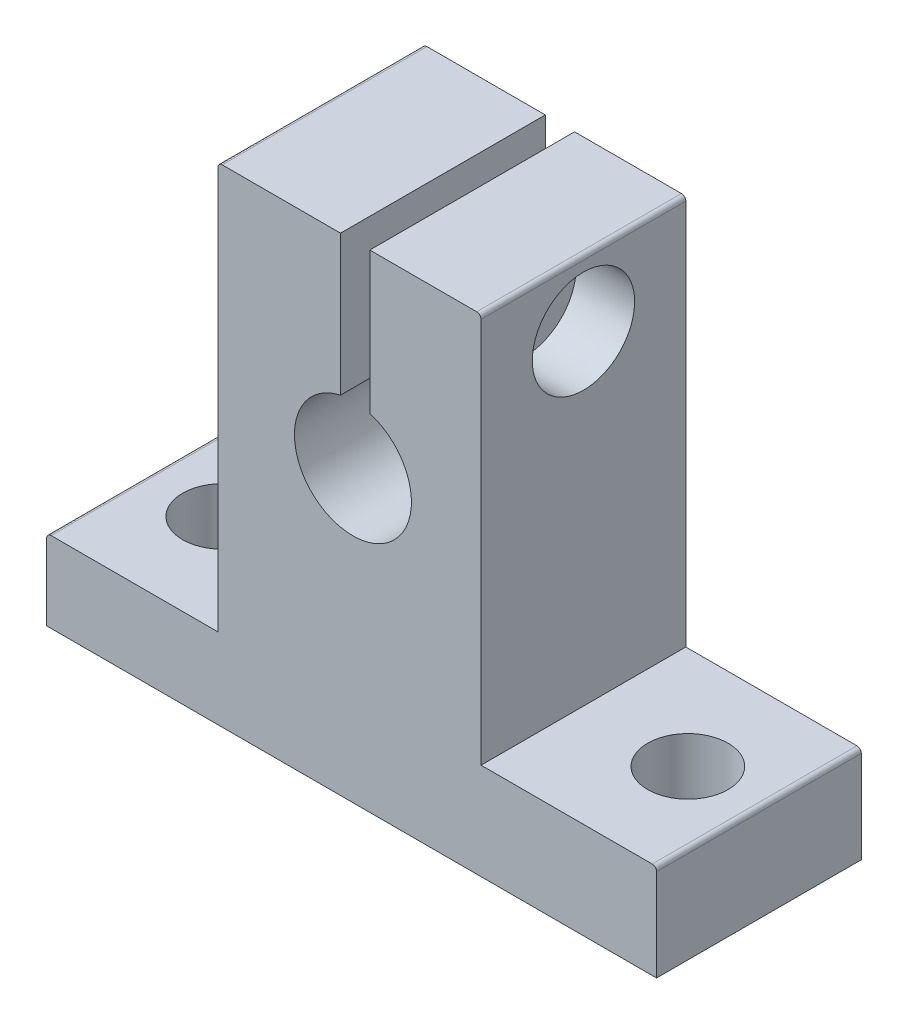
ISO-10303-21;
HEADER;
FILE_DESCRIPTION(('STEP AP214'),'2;1');
FILE_NAME('part.step','',(''),(''),'','','');
FILE_SCHEMA(('AUTOMOTIVE_DESIGN { 1 0 10303 214 1 1 1 1 }'));
ENDSEC;
DATA;
#1=APPLICATION_CONTEXT('core data for automotive mechanical design processes');
#2=APPLICATION_PROTOCOL_DEFINITION('international standard','automotive_design',2000,#1);
#3=PRODUCT_CONTEXT('',#1,'mechanical');
#4=PRODUCT('Part','Part','',(#3));
#5=PRODUCT_RELATED_PRODUCT_CATEGORY('part','',(#4));
#6=PRODUCT_DEFINITION_FORMATION('','',#4);
#7=PRODUCT_DEFINITION_CONTEXT('part definition',#1,'design');
#8=PRODUCT_DEFINITION('design','',#6,#7);
#9=PRODUCT_DEFINITION_SHAPE('','',#8);
#10=(LENGTH_UNIT() NAMED_UNIT(*) SI_UNIT(.MILLI.,.METRE.));
#11=(NAMED_UNIT(*) PLANE_ANGLE_UNIT() SI_UNIT($,.RADIAN.));
#12=(NAMED_UNIT(*) SI_UNIT($,.STERADIAN.) SOLID_ANGLE_UNIT());
#13=UNCERTAINTY_MEASURE_WITH_UNIT(LENGTH_MEASURE(1.E-05),#10,'distance_accuracy_value','');
#14=(GEOMETRIC_REPRESENTATION_CONTEXT(3) GLOBAL_UNCERTAINTY_ASSIGNED_CONTEXT((#13)) GLOBAL_UNIT_ASSIGNED_CONTEXT((#10,
#11,#12)) REPRESENTATION_CONTEXT('',''));
#15=CARTESIAN_POINT('',(0.,0.,0.));
#16=DIRECTION('',(0.,0.,1.));
#17=DIRECTION('',(1.,0.,0.));
#18=AXIS2_PLACEMENT_3D('',#15,#16,#17);
#19=CARTESIAN_POINT('',(-0.238905162453727,24.0864033921109,7.));
#20=DIRECTION('',(1.,0.,0.));
#21=DIRECTION('',(0.,1.,0.));
#22=AXIS2_PLACEMENT_3D('',#19,#20,#21);
#23=CYLINDRICAL_SURFACE('',#22,2.);
#24=CARTESIAN_POINT('',(1.15263000144478,24.0864033921109,7.));
#25=DIRECTION('',(1.,0.,0.));
#26=DIRECTION('',(0.,0.,-1.));
#27=AXIS2_PLACEMENT_3D('',#24,#25,#26);
#28=CIRCLE('',#27,2.);
#29=CARTESIAN_POINT('',(1.15263000144478,24.0864033921109,5.));
#30=VERTEX_POINT('',#29);
#31=EDGE_CURVE('E168',#30,#30,#28,.T.);
#32=ORIENTED_EDGE('',*,*,#31,.F.);
#33=EDGE_LOOP('',(#32));
#34=FACE_BOUND('',#33,.T.);
#35=CARTESIAN_POINT('',(4.76109483754627,24.0864033921109,7.));
#36=DIRECTION('',(1.,0.,0.));
#37=DIRECTION('',(0.,1.,0.));
#38=AXIS2_PLACEMENT_3D('',#35,#36,#37);
#39=CIRCLE('',#38,2.);
#40=CARTESIAN_POINT('',(4.76109483754627,26.0864033921109,7.));
#41=VERTEX_POINT('',#40);
#42=EDGE_CURVE('E233',#41,#41,#39,.F.);
#43=ORIENTED_EDGE('',*,*,#42,.F.);
#44=EDGE_LOOP('',(#43));
#45=FACE_BOUND('',#44,.T.);
#46=ADVANCED_FACE('F33',(#34,#45),#23,.F.);
#47=CARTESIAN_POINT('',(-9.23890516245373,28.5864033921109,14.));
#48=DIRECTION('',(0.,-1.,0.));
#49=DIRECTION('',(1.,0.,0.));
#50=AXIS2_PLACEMENT_3D('',#47,#48,#49);
#51=PLANE('',#50);
#52=DIRECTION('',(-1.,0.,0.));
#53=VECTOR('',#52,1.);
#54=CARTESIAN_POINT('',(-9.23890516245373,28.5864033921109,14.));
#55=LINE('',#54,#53);
#56=CARTESIAN_POINT('',(8.46109483754628,28.5864033921109,14.));
#57=VERTEX_POINT('',#56);
#58=CARTESIAN_POINT('',(1.15263000144478,28.5864033921109,14.));
#59=VERTEX_POINT('',#58);
#60=EDGE_CURVE('E166',#57,#59,#55,.T.);
#61=ORIENTED_EDGE('',*,*,#60,.F.);
#62=DIRECTION('',(0.,0.,-1.));
#63=VECTOR('',#62,1.);
#64=CARTESIAN_POINT('',(8.46109483754628,28.5864033921109,14.));
#65=LINE('',#64,#63);
#66=CARTESIAN_POINT('',(8.46109483754628,28.5864033921109,0.));
#67=VERTEX_POINT('',#66);
#68=EDGE_CURVE('E41',#57,#67,#65,.T.);
#69=ORIENTED_EDGE('',*,*,#68,.T.);
#70=DIRECTION('',(-1.,0.,0.));
#71=VECTOR('',#70,1.);
#72=CARTESIAN_POINT('',(-9.23890516245373,28.5864033921109,0.));
#73=LINE('',#72,#71);
#74=CARTESIAN_POINT('',(1.15263000144478,28.5864033921109,0.));
#75=VERTEX_POINT('',#74);
#76=EDGE_CURVE('E207',#67,#75,#73,.T.);
#77=ORIENTED_EDGE('',*,*,#76,.T.);
#78=DIRECTION('',(0.,0.,1.));
#79=VECTOR('',#78,1.);
#80=CARTESIAN_POINT('',(1.15263000144478,28.5864033921109,14.));
#81=LINE('',#80,#79);
#82=EDGE_CURVE('E291',#75,#59,#81,.T.);
#83=ORIENTED_EDGE('',*,*,#82,.T.);
#84=EDGE_LOOP('',(#61,#69,#77,#83));
#85=FACE_BOUND('',#84,.T.);
#86=ADVANCED_FACE('F274',(#85),#51,.F.);
#87=CARTESIAN_POINT('',(0.,0.,14.));
#88=DIRECTION('',(0.,0.,1.));
#89=DIRECTION('',(1.,0.,0.));
#90=AXIS2_PLACEMENT_3D('',#87,#88,#89);
#91=PLANE('',#90);
#92=DIRECTION('',(-1.,0.,0.));
#93=VECTOR('',#92,1.);
#94=CARTESIAN_POINT('',(-20.9389051624537,0.786403392110909,14.));
#95=LINE('',#94,#93);
#96=CARTESIAN_POINT('',(-9.23890516245372,0.786403392110911,14.));
#97=VERTEX_POINT('',#96);
#98=CARTESIAN_POINT('',(-20.6389051624537,0.786403392110909,14.));
#99=VERTEX_POINT('',#98);
#100=EDGE_CURVE('E196',#97,#99,#95,.T.);
#101=ORIENTED_EDGE('',*,*,#100,.T.);
#102=CARTESIAN_POINT('',(-20.6389051624537,0.48640339211091,14.));
#103=DIRECTION('',(0.,0.,1.));
#104=DIRECTION('',(1.,0.,0.));
#105=AXIS2_PLACEMENT_3D('',#102,#103,#104);
#106=CIRCLE('',#105,0.3);
#107=CARTESIAN_POINT('',(-20.9389051624537,0.48640339211091,14.));
#108=VERTEX_POINT('',#107);
#109=EDGE_CURVE('E259',#99,#108,#106,.T.);
#110=ORIENTED_EDGE('',*,*,#109,.T.);
#111=DIRECTION('',(0.,-1.,0.));
#112=VECTOR('',#111,1.);
#113=CARTESIAN_POINT('',(-20.9389051624537,0.786403392110909,14.));
#114=LINE('',#113,#112);
#115=CARTESIAN_POINT('',(-20.9389051624537,-4.71359660788909,14.));
#116=VERTEX_POINT('',#115);
#117=EDGE_CURVE('E198',#108,#116,#114,.T.);
#118=ORIENTED_EDGE('',*,*,#117,.T.);
#119=DIRECTION('',(1.,0.,0.));
#120=VECTOR('',#119,1.);
#121=CARTESIAN_POINT('',(-20.9389051624537,-4.71359660788909,14.));
#122=LINE('',#121,#120);
#123=CARTESIAN_POINT('',(20.7610948375463,-4.71359660788909,14.));
#124=VERTEX_POINT('',#123);
#125=EDGE_CURVE('E200',#116,#124,#122,.T.);
#126=ORIENTED_EDGE('',*,*,#125,.T.);
#127=DIRECTION('',(0.,1.,0.));
#128=VECTOR('',#127,1.);
#129=CARTESIAN_POINT('',(20.7610948375463,1.88640339211091,14.));
#130=LINE('',#129,#128);
#131=CARTESIAN_POINT('',(20.7610948375463,1.58640339211091,14.));
#132=VERTEX_POINT('',#131);
#133=EDGE_CURVE('E184',#124,#132,#130,.T.);
#134=ORIENTED_EDGE('',*,*,#133,.T.);
#135=CARTESIAN_POINT('',(20.4610948375463,1.58640339211091,14.));
#136=DIRECTION('',(0.,0.,1.));
#137=DIRECTION('',(1.,0.,0.));
#138=AXIS2_PLACEMENT_3D('',#135,#136,#137);
#139=CIRCLE('',#138,0.3);
#140=CARTESIAN_POINT('',(20.4610948375463,1.88640339211091,14.));
#141=VERTEX_POINT('',#140);
#142=EDGE_CURVE('E257',#132,#141,#139,.T.);
#143=ORIENTED_EDGE('',*,*,#142,.T.);
#144=DIRECTION('',(-1.,0.,0.));
#145=VECTOR('',#144,1.);
#146=CARTESIAN_POINT('',(8.76109483754628,1.88640339211091,14.));
#147=LINE('',#146,#145);
#148=CARTESIAN_POINT('',(8.76109483754628,1.88640339211091,14.));
#149=VERTEX_POINT('',#148);
#150=EDGE_CURVE('E187',#141,#149,#147,.T.);
#151=ORIENTED_EDGE('',*,*,#150,.T.);
#152=DIRECTION('',(0.,1.,0.));
#153=VECTOR('',#152,1.);
#154=CARTESIAN_POINT('',(8.76109483754627,28.5864033921109,14.));
#155=LINE('',#154,#153);
#156=CARTESIAN_POINT('',(8.76109483754627,28.2864033921109,14.));
#157=VERTEX_POINT('',#156);
#158=EDGE_CURVE('E190',#149,#157,#155,.T.);
#159=ORIENTED_EDGE('',*,*,#158,.T.);
#160=CARTESIAN_POINT('',(8.46109483754628,28.2864033921109,14.));
#161=DIRECTION('',(0.,0.,1.));
#162=DIRECTION('',(1.,0.,0.));
#163=AXIS2_PLACEMENT_3D('',#160,#161,#162);
#164=CIRCLE('',#163,0.3);
#165=EDGE_CURVE('E48',#157,#57,#164,.T.);
#166=ORIENTED_EDGE('',*,*,#165,.T.);
#167=ORIENTED_EDGE('',*,*,#60,.T.);
#168=DIRECTION('',(0.,1.,0.));
#169=VECTOR('',#168,1.);
#170=CARTESIAN_POINT('',(1.15263000144478,29.6829816442185,14.));
#171=LINE('',#170,#169);
#172=CARTESIAN_POINT('',(1.15263000144478,18.916735503008,14.));
#173=VERTEX_POINT('',#172);
#174=EDGE_CURVE('E150',#173,#59,#171,.T.);
#175=ORIENTED_EDGE('',*,*,#174,.F.);
#176=CARTESIAN_POINT('',(0.,15.0864033921109,14.));
#177=DIRECTION('',(0.,0.,1.));
#178=DIRECTION('',(1.,0.,0.));
#179=AXIS2_PLACEMENT_3D('',#176,#177,#178);
#180=CIRCLE('',#179,4.);
#181=CARTESIAN_POINT('',(-0.847369998555217,18.9956186695737,14.));
#182=VERTEX_POINT('',#181);
#183=EDGE_CURVE('E165',#182,#173,#180,.T.);
#184=ORIENTED_EDGE('',*,*,#183,.F.);
#185=DIRECTION('',(0.,-1.,0.));
#186=VECTOR('',#185,1.);
#187=CARTESIAN_POINT('',(-0.847369998555218,29.6829816442185,14.));
#188=LINE('',#187,#186);
#189=CARTESIAN_POINT('',(-0.847369998555218,28.5864033921109,14.));
#190=VERTEX_POINT('',#189);
#191=EDGE_CURVE('E167',#190,#182,#188,.T.);
#192=ORIENTED_EDGE('',*,*,#191,.F.);
#193=CARTESIAN_POINT('',(-8.93890516245373,28.5864033921109,14.));
#194=VERTEX_POINT('',#193);
#195=EDGE_CURVE('E192',#190,#194,#55,.T.);
#196=ORIENTED_EDGE('',*,*,#195,.T.);
#197=CARTESIAN_POINT('',(-8.93890516245373,28.2864033921109,14.));
#198=DIRECTION('',(0.,0.,1.));
#199=DIRECTION('',(1.,0.,0.));
#200=AXIS2_PLACEMENT_3D('',#197,#198,#199);
#201=CIRCLE('',#200,0.3);
#202=CARTESIAN_POINT('',(-9.23890516245373,28.2864033921109,14.));
#203=VERTEX_POINT('',#202);
#204=EDGE_CURVE('E255',#194,#203,#201,.T.);
#205=ORIENTED_EDGE('',*,*,#204,.T.);
#206=DIRECTION('',(0.,-1.,0.));
#207=VECTOR('',#206,1.);
#208=CARTESIAN_POINT('',(-9.23890516245373,28.5864033921109,14.));
#209=LINE('',#208,#207);
#210=EDGE_CURVE('E194',#203,#97,#209,.T.);
#211=ORIENTED_EDGE('',*,*,#210,.T.);
#212=EDGE_LOOP('',(#101,#110,#118,#126,#134,#143,#151,#159,#166,#167,#175,#184,#192,#196,#205,#211));
#213=FACE_BOUND('',#212,.T.);
#214=ADVANCED_FACE('F163',(#213),#91,.T.);
#215=CARTESIAN_POINT('',(0.,0.,0.));
#216=DIRECTION('',(0.,0.,1.));
#217=DIRECTION('',(1.,0.,0.));
#218=AXIS2_PLACEMENT_3D('',#215,#216,#217);
#219=PLANE('',#218);
#220=DIRECTION('',(0.,-1.,0.));
#221=VECTOR('',#220,1.);
#222=CARTESIAN_POINT('',(-20.9389051624537,0.786403392110909,0.));
#223=LINE('',#222,#221);
#224=CARTESIAN_POINT('',(-20.9389051624537,0.48640339211091,0.));
#225=VERTEX_POINT('',#224);
#226=CARTESIAN_POINT('',(-20.9389051624537,-4.71359660788909,0.));
#227=VERTEX_POINT('',#226);
#228=EDGE_CURVE('E214',#225,#227,#223,.T.);
#229=ORIENTED_EDGE('',*,*,#228,.F.);
#230=CARTESIAN_POINT('',(-20.6389051624537,0.48640339211091,0.));
#231=DIRECTION('',(0.,0.,1.));
#232=DIRECTION('',(1.,0.,0.));
#233=AXIS2_PLACEMENT_3D('',#230,#231,#232);
#234=CIRCLE('',#233,0.3);
#235=CARTESIAN_POINT('',(-20.6389051624537,0.786403392110909,0.));
#236=VERTEX_POINT('',#235);
#237=EDGE_CURVE('E250',#225,#236,#234,.F.);
#238=ORIENTED_EDGE('',*,*,#237,.T.);
#239=DIRECTION('',(-1.,0.,0.));
#240=VECTOR('',#239,1.);
#241=CARTESIAN_POINT('',(-20.9389051624537,0.786403392110909,0.));
#242=LINE('',#241,#240);
#243=CARTESIAN_POINT('',(-9.23890516245372,0.786403392110911,0.));
#244=VERTEX_POINT('',#243);
#245=EDGE_CURVE('E211',#244,#236,#242,.T.);
#246=ORIENTED_EDGE('',*,*,#245,.F.);
#247=DIRECTION('',(0.,-1.,0.));
#248=VECTOR('',#247,1.);
#249=CARTESIAN_POINT('',(-9.23890516245373,28.5864033921109,0.));
#250=LINE('',#249,#248);
#251=CARTESIAN_POINT('',(-9.23890516245373,28.2864033921109,0.));
#252=VERTEX_POINT('',#251);
#253=EDGE_CURVE('E209',#252,#244,#250,.T.);
#254=ORIENTED_EDGE('',*,*,#253,.F.);
#255=CARTESIAN_POINT('',(-8.93890516245373,28.2864033921109,0.));
#256=DIRECTION('',(0.,0.,1.));
#257=DIRECTION('',(1.,0.,0.));
#258=AXIS2_PLACEMENT_3D('',#255,#256,#257);
#259=CIRCLE('',#258,0.3);
#260=CARTESIAN_POINT('',(-8.93890516245373,28.5864033921109,0.));
#261=VERTEX_POINT('',#260);
#262=EDGE_CURVE('E246',#252,#261,#259,.F.);
#263=ORIENTED_EDGE('',*,*,#262,.T.);
#264=CARTESIAN_POINT('',(-0.847369998555218,28.5864033921109,0.));
#265=VERTEX_POINT('',#264);
#266=EDGE_CURVE('E206',#265,#261,#73,.T.);
#267=ORIENTED_EDGE('',*,*,#266,.F.);
#268=DIRECTION('',(0.,-1.,0.));
#269=VECTOR('',#268,1.);
#270=CARTESIAN_POINT('',(-0.847369998555218,29.6829816442185,0.));
#271=LINE('',#270,#269);
#272=CARTESIAN_POINT('',(-0.847369998555217,18.9956186695737,0.));
#273=VERTEX_POINT('',#272);
#274=EDGE_CURVE('E281',#265,#273,#271,.T.);
#275=ORIENTED_EDGE('',*,*,#274,.T.);
#276=CARTESIAN_POINT('',(0.,15.0864033921109,0.));
#277=DIRECTION('',(0.,0.,1.));
#278=DIRECTION('',(1.,0.,0.));
#279=AXIS2_PLACEMENT_3D('',#276,#277,#278);
#280=CIRCLE('',#279,4.);
#281=CARTESIAN_POINT('',(1.15263000144478,18.916735503008,0.));
#282=VERTEX_POINT('',#281);
#283=EDGE_CURVE('E173',#273,#282,#280,.T.);
#284=ORIENTED_EDGE('',*,*,#283,.T.);
#285=DIRECTION('',(0.,1.,0.));
#286=VECTOR('',#285,1.);
#287=CARTESIAN_POINT('',(1.15263000144478,29.6829816442185,0.));
#288=LINE('',#287,#286);
#289=EDGE_CURVE('E153',#282,#75,#288,.T.);
#290=ORIENTED_EDGE('',*,*,#289,.T.);
#291=ORIENTED_EDGE('',*,*,#76,.F.);
#292=CARTESIAN_POINT('',(8.46109483754628,28.2864033921109,0.));
#293=DIRECTION('',(0.,0.,1.));
#294=DIRECTION('',(1.,0.,0.));
#295=AXIS2_PLACEMENT_3D('',#292,#293,#294);
#296=CIRCLE('',#295,0.3);
#297=CARTESIAN_POINT('',(8.76109483754627,28.2864033921109,0.));
#298=VERTEX_POINT('',#297);
#299=EDGE_CURVE('E244',#67,#298,#296,.F.);
#300=ORIENTED_EDGE('',*,*,#299,.T.);
#301=DIRECTION('',(0.,1.,0.));
#302=VECTOR('',#301,1.);
#303=CARTESIAN_POINT('',(8.76109483754627,28.5864033921109,0.));
#304=LINE('',#303,#302);
#305=CARTESIAN_POINT('',(8.76109483754628,1.88640339211091,0.));
#306=VERTEX_POINT('',#305);
#307=EDGE_CURVE('E204',#306,#298,#304,.T.);
#308=ORIENTED_EDGE('',*,*,#307,.F.);
#309=DIRECTION('',(-1.,0.,0.));
#310=VECTOR('',#309,1.);
#311=CARTESIAN_POINT('',(8.76109483754628,1.88640339211091,0.));
#312=LINE('',#311,#310);
#313=CARTESIAN_POINT('',(20.4610948375463,1.88640339211091,0.));
#314=VERTEX_POINT('',#313);
#315=EDGE_CURVE('E176',#314,#306,#312,.T.);
#316=ORIENTED_EDGE('',*,*,#315,.F.);
#317=CARTESIAN_POINT('',(20.4610948375463,1.58640339211091,0.));
#318=DIRECTION('',(0.,0.,1.));
#319=DIRECTION('',(1.,0.,0.));
#320=AXIS2_PLACEMENT_3D('',#317,#318,#319);
#321=CIRCLE('',#320,0.3);
#322=CARTESIAN_POINT('',(20.7610948375463,1.58640339211091,0.));
#323=VERTEX_POINT('',#322);
#324=EDGE_CURVE('E248',#314,#323,#321,.F.);
#325=ORIENTED_EDGE('',*,*,#324,.T.);
#326=DIRECTION('',(0.,1.,0.));
#327=VECTOR('',#326,1.);
#328=CARTESIAN_POINT('',(20.7610948375463,1.88640339211091,0.));
#329=LINE('',#328,#327);
#330=CARTESIAN_POINT('',(20.7610948375463,-4.71359660788909,0.));
#331=VERTEX_POINT('',#330);
#332=EDGE_CURVE('E172',#331,#323,#329,.T.);
#333=ORIENTED_EDGE('',*,*,#332,.F.);
#334=DIRECTION('',(1.,0.,0.));
#335=VECTOR('',#334,1.);
#336=CARTESIAN_POINT('',(-20.9389051624537,-4.71359660788909,0.));
#337=LINE('',#336,#335);
#338=EDGE_CURVE('E188',#227,#331,#337,.T.);
#339=ORIENTED_EDGE('',*,*,#338,.F.);
#340=EDGE_LOOP('',(#229,#238,#246,#254,#263,#267,#275,#284,#290,#291,#300,#308,#316,#325,#333,#339));
#341=FACE_BOUND('',#340,.T.);
#342=ADVANCED_FACE('F278',(#341),#219,.F.);
#343=CARTESIAN_POINT('',(20.7610948375463,1.88640339211091,14.));
#344=DIRECTION('',(-1.,0.,0.));
#345=DIRECTION('',(0.,0.,1.));
#346=AXIS2_PLACEMENT_3D('',#343,#344,#345);
#347=PLANE('',#346);
#348=ORIENTED_EDGE('',*,*,#332,.T.);
#349=DIRECTION('',(0.,0.,-1.));
#350=VECTOR('',#349,1.);
#351=CARTESIAN_POINT('',(20.7610948375463,1.58640339211091,14.));
#352=LINE('',#351,#350);
#353=EDGE_CURVE('E264',#323,#132,#352,.F.);
#354=ORIENTED_EDGE('',*,*,#353,.T.);
#355=ORIENTED_EDGE('',*,*,#133,.F.);
#356=DIRECTION('',(0.,0.,-1.));
#357=VECTOR('',#356,1.);
#358=CARTESIAN_POINT('',(20.7610948375463,-4.71359660788909,14.));
#359=LINE('',#358,#357);
#360=EDGE_CURVE('E201',#124,#331,#359,.T.);
#361=ORIENTED_EDGE('',*,*,#360,.T.);
#362=EDGE_LOOP('',(#348,#354,#355,#361));
#363=FACE_BOUND('',#362,.T.);
#364=ADVANCED_FACE('F305',(#363),#347,.F.);
#365=CARTESIAN_POINT('',(8.76109483754628,1.88640339211091,14.));
#366=DIRECTION('',(0.,-1.,0.));
#367=DIRECTION('',(0.,0.,-1.));
#368=AXIS2_PLACEMENT_3D('',#365,#366,#367);
#369=PLANE('',#368);
#370=CARTESIAN_POINT('',(15.9,1.88640339211091,7.));
#371=DIRECTION('',(0.,1.,0.));
#372=DIRECTION('',(0.,0.,1.));
#373=AXIS2_PLACEMENT_3D('',#370,#371,#372);
#374=CIRCLE('',#373,2.75);
#375=CARTESIAN_POINT('',(15.9,1.88640339211091,9.75));
#376=VERTEX_POINT('',#375);
#377=EDGE_CURVE('E293',#376,#376,#374,.T.);
#378=ORIENTED_EDGE('',*,*,#377,.F.);
#379=EDGE_LOOP('',(#378));
#380=FACE_BOUND('',#379,.T.);
#381=ORIENTED_EDGE('',*,*,#150,.F.);
#382=DIRECTION('',(0.,0.,-1.));
#383=VECTOR('',#382,1.);
#384=CARTESIAN_POINT('',(20.4610948375463,1.88640339211091,14.));
#385=LINE('',#384,#383);
#386=EDGE_CURVE('E261',#141,#314,#385,.T.);
#387=ORIENTED_EDGE('',*,*,#386,.T.);
#388=ORIENTED_EDGE('',*,*,#315,.T.);
#389=DIRECTION('',(0.,0.,-1.));
#390=VECTOR('',#389,1.);
#391=CARTESIAN_POINT('',(8.76109483754628,1.88640339211091,14.));
#392=LINE('',#391,#390);
#393=EDGE_CURVE('E225',#149,#306,#392,.T.);
#394=ORIENTED_EDGE('',*,*,#393,.F.);
#395=EDGE_LOOP('',(#381,#387,#388,#394));
#396=FACE_BOUND('',#395,.T.);
#397=ADVANCED_FACE('F301',(#380,#396),#369,.F.);
#398=CARTESIAN_POINT('',(8.76109483754627,28.5864033921109,14.));
#399=DIRECTION('',(-1.,0.,0.));
#400=DIRECTION('',(0.,-1.,0.));
#401=AXIS2_PLACEMENT_3D('',#398,#399,#400);
#402=PLANE('',#401);
#403=CARTESIAN_POINT('',(8.76109483754627,24.0864033921109,7.));
#404=DIRECTION('',(1.,0.,0.));
#405=DIRECTION('',(0.,1.,0.));
#406=AXIS2_PLACEMENT_3D('',#403,#404,#405);
#407=CIRCLE('',#406,3.5);
#408=CARTESIAN_POINT('',(8.76109483754627,27.5864033921109,7.));
#409=VERTEX_POINT('',#408);
#410=EDGE_CURVE('E240',#409,#409,#407,.T.);
#411=ORIENTED_EDGE('',*,*,#410,.F.);
#412=EDGE_LOOP('',(#411));
#413=FACE_BOUND('',#412,.T.);
#414=ORIENTED_EDGE('',*,*,#307,.T.);
#415=DIRECTION('',(0.,0.,-1.));
#416=VECTOR('',#415,1.);
#417=CARTESIAN_POINT('',(8.76109483754627,28.2864033921109,14.));
#418=LINE('',#417,#416);
#419=EDGE_CURVE('E11',#298,#157,#418,.F.);
#420=ORIENTED_EDGE('',*,*,#419,.T.);
#421=ORIENTED_EDGE('',*,*,#158,.F.);
#422=ORIENTED_EDGE('',*,*,#393,.T.);
#423=EDGE_LOOP('',(#414,#420,#421,#422));
#424=FACE_BOUND('',#423,.T.);
#425=ADVANCED_FACE('F304',(#413,#424),#402,.F.);
#426=ORIENTED_EDGE('',*,*,#266,.T.);
#427=DIRECTION('',(0.,0.,-1.));
#428=VECTOR('',#427,1.);
#429=CARTESIAN_POINT('',(-8.93890516245373,28.5864033921109,14.));
#430=LINE('',#429,#428);
#431=EDGE_CURVE('E269',#261,#194,#430,.F.);
#432=ORIENTED_EDGE('',*,*,#431,.T.);
#433=ORIENTED_EDGE('',*,*,#195,.F.);
#434=DIRECTION('',(0.,0.,-1.));
#435=VECTOR('',#434,1.);
#436=CARTESIAN_POINT('',(-0.847369998555218,28.5864033921109,14.));
#437=LINE('',#436,#435);
#438=EDGE_CURVE('E283',#190,#265,#437,.T.);
#439=ORIENTED_EDGE('',*,*,#438,.T.);
#440=EDGE_LOOP('',(#426,#432,#433,#439));
#441=FACE_BOUND('',#440,.T.);
#442=ADVANCED_FACE('F349',(#441),#51,.F.);
#443=CARTESIAN_POINT('',(-9.23890516245373,28.5864033921109,14.));
#444=DIRECTION('',(1.,0.,0.));
#445=DIRECTION('',(0.,1.,0.));
#446=AXIS2_PLACEMENT_3D('',#443,#444,#445);
#447=PLANE('',#446);
#448=CARTESIAN_POINT('',(-9.23890516245373,24.0864033921109,7.));
#449=DIRECTION('',(-1.,0.,0.));
#450=DIRECTION('',(0.,-1.,0.));
#451=AXIS2_PLACEMENT_3D('',#448,#449,#450);
#452=CIRCLE('',#451,1.85);
#453=CARTESIAN_POINT('',(-9.23890516245373,22.2364033921109,7.));
#454=VERTEX_POINT('',#453);
#455=EDGE_CURVE('E241',#454,#454,#452,.T.);
#456=ORIENTED_EDGE('',*,*,#455,.F.);
#457=EDGE_LOOP('',(#456));
#458=FACE_BOUND('',#457,.T.);
#459=ORIENTED_EDGE('',*,*,#210,.F.);
#460=DIRECTION('',(0.,0.,-1.));
#461=VECTOR('',#460,1.);
#462=CARTESIAN_POINT('',(-9.23890516245373,28.2864033921109,14.));
#463=LINE('',#462,#461);
#464=EDGE_CURVE('E266',#203,#252,#463,.T.);
#465=ORIENTED_EDGE('',*,*,#464,.T.);
#466=ORIENTED_EDGE('',*,*,#253,.T.);
#467=DIRECTION('',(0.,0.,-1.));
#468=VECTOR('',#467,1.);
#469=CARTESIAN_POINT('',(-9.23890516245372,0.786403392110911,14.));
#470=LINE('',#469,#468);
#471=EDGE_CURVE('E222',#97,#244,#470,.T.);
#472=ORIENTED_EDGE('',*,*,#471,.F.);
#473=EDGE_LOOP('',(#459,#465,#466,#472));
#474=FACE_BOUND('',#473,.T.);
#475=ADVANCED_FACE('F342',(#458,#474),#447,.F.);
#476=CARTESIAN_POINT('',(-20.9389051624537,0.786403392110909,14.));
#477=DIRECTION('',(0.,-1.,0.));
#478=DIRECTION('',(1.,0.,0.));
#479=AXIS2_PLACEMENT_3D('',#476,#477,#478);
#480=PLANE('',#479);
#481=CARTESIAN_POINT('',(-15.9,0.78640339211091,7.));
#482=DIRECTION('',(0.,-1.,0.));
#483=DIRECTION('',(1.,0.,0.));
#484=AXIS2_PLACEMENT_3D('',#481,#482,#483);
#485=CIRCLE('',#484,2.75);
#486=CARTESIAN_POINT('',(-13.15,0.786403392110911,7.));
#487=VERTEX_POINT('',#486);
#488=EDGE_CURVE('E178',#487,#487,#485,.T.);
#489=ORIENTED_EDGE('',*,*,#488,.T.);
#490=EDGE_LOOP('',(#489));
#491=FACE_BOUND('',#490,.T.);
#492=ORIENTED_EDGE('',*,*,#245,.T.);
#493=DIRECTION('',(0.,0.,-1.));
#494=VECTOR('',#493,1.);
#495=CARTESIAN_POINT('',(-20.6389051624537,0.786403392110909,14.));
#496=LINE('',#495,#494);
#497=EDGE_CURVE('E252',#236,#99,#496,.F.);
#498=ORIENTED_EDGE('',*,*,#497,.T.);
#499=ORIENTED_EDGE('',*,*,#100,.F.);
#500=ORIENTED_EDGE('',*,*,#471,.T.);
#501=EDGE_LOOP('',(#492,#498,#499,#500));
#502=FACE_BOUND('',#501,.T.);
#503=ADVANCED_FACE('F335',(#491,#502),#480,.F.);
#504=CARTESIAN_POINT('',(-20.9389051624537,0.786403392110909,14.));
#505=DIRECTION('',(1.,0.,0.));
#506=DIRECTION('',(0.,0.,-1.));
#507=AXIS2_PLACEMENT_3D('',#504,#505,#506);
#508=PLANE('',#507);
#509=ORIENTED_EDGE('',*,*,#117,.F.);
#510=DIRECTION('',(0.,0.,-1.));
#511=VECTOR('',#510,1.);
#512=CARTESIAN_POINT('',(-20.9389051624537,0.48640339211091,14.));
#513=LINE('',#512,#511);
#514=EDGE_CURVE('E158',#108,#225,#513,.T.);
#515=ORIENTED_EDGE('',*,*,#514,.T.);
#516=ORIENTED_EDGE('',*,*,#228,.T.);
#517=DIRECTION('',(0.,0.,-1.));
#518=VECTOR('',#517,1.);
#519=CARTESIAN_POINT('',(-20.9389051624537,-4.71359660788909,14.));
#520=LINE('',#519,#518);
#521=EDGE_CURVE('E219',#116,#227,#520,.T.);
#522=ORIENTED_EDGE('',*,*,#521,.F.);
#523=EDGE_LOOP('',(#509,#515,#516,#522));
#524=FACE_BOUND('',#523,.T.);
#525=ADVANCED_FACE('F327',(#524),#508,.F.);
#526=CARTESIAN_POINT('',(-20.9389051624537,-4.71359660788909,14.));
#527=DIRECTION('',(0.,1.,0.));
#528=DIRECTION('',(0.,0.,1.));
#529=AXIS2_PLACEMENT_3D('',#526,#527,#528);
#530=PLANE('',#529);
#531=ORIENTED_EDGE('',*,*,#338,.T.);
#532=ORIENTED_EDGE('',*,*,#360,.F.);
#533=ORIENTED_EDGE('',*,*,#125,.F.);
#534=ORIENTED_EDGE('',*,*,#521,.T.);
#535=EDGE_LOOP('',(#531,#532,#533,#534));
#536=FACE_BOUND('',#535,.T.);
#537=ADVANCED_FACE('F322',(#536),#530,.F.);
#538=CARTESIAN_POINT('',(0.,15.0864033921109,14.));
#539=DIRECTION('',(0.,0.,-1.));
#540=DIRECTION('',(-1.,0.,0.));
#541=AXIS2_PLACEMENT_3D('',#538,#539,#540);
#542=CYLINDRICAL_SURFACE('',#541,4.);
#543=DIRECTION('',(0.,0.,-1.));
#544=VECTOR('',#543,1.);
#545=CARTESIAN_POINT('',(1.15263000144478,18.916735503008,14.));
#546=LINE('',#545,#544);
#547=EDGE_CURVE('E146',#282,#173,#546,.F.);
#548=ORIENTED_EDGE('',*,*,#547,.F.);
#549=ORIENTED_EDGE('',*,*,#283,.F.);
#550=DIRECTION('',(0.,0.,-1.));
#551=VECTOR('',#550,1.);
#552=CARTESIAN_POINT('',(-0.847369998555217,18.9956186695737,14.));
#553=LINE('',#552,#551);
#554=EDGE_CURVE('E159',#182,#273,#553,.T.);
#555=ORIENTED_EDGE('',*,*,#554,.F.);
#556=ORIENTED_EDGE('',*,*,#183,.T.);
#557=EDGE_LOOP('',(#548,#549,#555,#556));
#558=FACE_BOUND('',#557,.T.);
#559=ADVANCED_FACE('F171',(#558),#542,.F.);
#560=CARTESIAN_POINT('',(-15.9,-4.11359660788909,7.));
#561=DIRECTION('',(0.,1.,0.));
#562=DIRECTION('',(0.,0.,1.));
#563=AXIS2_PLACEMENT_3D('',#560,#561,#562);
#564=CYLINDRICAL_SURFACE('',#563,2.75);
#565=CARTESIAN_POINT('',(-15.9,-4.11359660788909,7.));
#566=DIRECTION('',(0.,1.,0.));
#567=DIRECTION('',(0.,0.,1.));
#568=AXIS2_PLACEMENT_3D('',#565,#566,#567);
#569=CIRCLE('',#568,2.75);
#570=CARTESIAN_POINT('',(-15.9,-4.11359660788909,9.75));
#571=VERTEX_POINT('',#570);
#572=EDGE_CURVE('E181',#571,#571,#569,.T.);
#573=ORIENTED_EDGE('',*,*,#572,.F.);
#574=EDGE_LOOP('',(#573));
#575=FACE_BOUND('',#574,.T.);
#576=ORIENTED_EDGE('',*,*,#488,.F.);
#577=EDGE_LOOP('',(#576));
#578=FACE_BOUND('',#577,.T.);
#579=ADVANCED_FACE('F389',(#575,#578),#564,.F.);
#580=CARTESIAN_POINT('',(-15.9,-4.11359660788909,7.));
#581=DIRECTION('',(0.,1.,0.));
#582=DIRECTION('',(0.,0.,1.));
#583=AXIS2_PLACEMENT_3D('',#580,#581,#582);
#584=PLANE('',#583);
#585=ORIENTED_EDGE('',*,*,#572,.T.);
#586=EDGE_LOOP('',(#585));
#587=FACE_BOUND('',#586,.T.);
#588=ADVANCED_FACE('F385',(#587),#584,.T.);
#589=CARTESIAN_POINT('',(15.9,-4.11359660788909,7.));
#590=DIRECTION('',(0.,1.,0.));
#591=DIRECTION('',(0.,0.,1.));
#592=AXIS2_PLACEMENT_3D('',#589,#590,#591);
#593=CYLINDRICAL_SURFACE('',#592,2.75);
#594=CARTESIAN_POINT('',(15.9,-4.11359660788909,7.));
#595=DIRECTION('',(0.,1.,0.));
#596=DIRECTION('',(0.,0.,1.));
#597=AXIS2_PLACEMENT_3D('',#594,#595,#596);
#598=CIRCLE('',#597,2.75);
#599=CARTESIAN_POINT('',(15.9,-4.11359660788909,9.75));
#600=VERTEX_POINT('',#599);
#601=EDGE_CURVE('E294',#600,#600,#598,.T.);
#602=ORIENTED_EDGE('',*,*,#601,.F.);
#603=EDGE_LOOP('',(#602));
#604=FACE_BOUND('',#603,.T.);
#605=ORIENTED_EDGE('',*,*,#377,.T.);
#606=EDGE_LOOP('',(#605));
#607=FACE_BOUND('',#606,.T.);
#608=ADVANCED_FACE('F299',(#604,#607),#593,.F.);
#609=CARTESIAN_POINT('',(15.9,-4.11359660788909,7.));
#610=DIRECTION('',(0.,1.,0.));
#611=DIRECTION('',(0.,0.,1.));
#612=AXIS2_PLACEMENT_3D('',#609,#610,#611);
#613=PLANE('',#612);
#614=ORIENTED_EDGE('',*,*,#601,.T.);
#615=EDGE_LOOP('',(#614));
#616=FACE_BOUND('',#615,.T.);
#617=ADVANCED_FACE('F374',(#616),#613,.T.);
#618=CARTESIAN_POINT('',(-0.847369998555218,29.6829816442185,0.));
#619=DIRECTION('',(-1.,0.,0.));
#620=DIRECTION('',(0.,-1.,0.));
#621=AXIS2_PLACEMENT_3D('',#618,#619,#620);
#622=PLANE('',#621);
#623=CARTESIAN_POINT('',(-0.847369998555217,24.0864033921109,7.));
#624=DIRECTION('',(-1.,0.,0.));
#625=DIRECTION('',(0.,-1.,0.));
#626=AXIS2_PLACEMENT_3D('',#623,#624,#625);
#627=CIRCLE('',#626,1.85);
#628=CARTESIAN_POINT('',(-0.847369998555217,22.2364033921109,7.));
#629=VERTEX_POINT('',#628);
#630=EDGE_CURVE('E237',#629,#629,#627,.T.);
#631=ORIENTED_EDGE('',*,*,#630,.T.);
#632=EDGE_LOOP('',(#631));
#633=FACE_BOUND('',#632,.T.);
#634=ORIENTED_EDGE('',*,*,#191,.T.);
#635=ORIENTED_EDGE('',*,*,#554,.T.);
#636=ORIENTED_EDGE('',*,*,#274,.F.);
#637=ORIENTED_EDGE('',*,*,#438,.F.);
#638=EDGE_LOOP('',(#634,#635,#636,#637));
#639=FACE_BOUND('',#638,.T.);
#640=ADVANCED_FACE('F371',(#633,#639),#622,.F.);
#641=CARTESIAN_POINT('',(1.15263000144478,29.6829816442185,0.));
#642=DIRECTION('',(1.,0.,0.));
#643=DIRECTION('',(0.,0.,-1.));
#644=AXIS2_PLACEMENT_3D('',#641,#642,#643);
#645=PLANE('',#644);
#646=ORIENTED_EDGE('',*,*,#31,.T.);
#647=EDGE_LOOP('',(#646));
#648=FACE_BOUND('',#647,.T.);
#649=ORIENTED_EDGE('',*,*,#289,.F.);
#650=ORIENTED_EDGE('',*,*,#547,.T.);
#651=ORIENTED_EDGE('',*,*,#174,.T.);
#652=ORIENTED_EDGE('',*,*,#82,.F.);
#653=EDGE_LOOP('',(#649,#650,#651,#652));
#654=FACE_BOUND('',#653,.T.);
#655=ADVANCED_FACE('F148',(#648,#654),#645,.F.);
#656=CARTESIAN_POINT('',(4.76109483754627,24.0864033921109,7.));
#657=DIRECTION('',(1.,0.,0.));
#658=DIRECTION('',(0.,1.,0.));
#659=AXIS2_PLACEMENT_3D('',#656,#657,#658);
#660=PLANE('',#659);
#661=CARTESIAN_POINT('',(4.76109483754627,24.0864033921109,7.));
#662=DIRECTION('',(1.,0.,0.));
#663=DIRECTION('',(0.,1.,0.));
#664=AXIS2_PLACEMENT_3D('',#661,#662,#663);
#665=CIRCLE('',#664,3.5);
#666=CARTESIAN_POINT('',(4.76109483754627,27.5864033921109,7.));
#667=VERTEX_POINT('',#666);
#668=EDGE_CURVE('E236',#667,#667,#665,.T.);
#669=ORIENTED_EDGE('',*,*,#668,.T.);
#670=EDGE_LOOP('',(#669));
#671=FACE_BOUND('',#670,.T.);
#672=ORIENTED_EDGE('',*,*,#42,.T.);
#673=EDGE_LOOP('',(#672));
#674=FACE_BOUND('',#673,.T.);
#675=ADVANCED_FACE('F378',(#671,#674),#660,.T.);
#676=CARTESIAN_POINT('',(4.76109483754627,24.0864033921109,7.));
#677=DIRECTION('',(1.,0.,0.));
#678=DIRECTION('',(0.,1.,0.));
#679=AXIS2_PLACEMENT_3D('',#676,#677,#678);
#680=CYLINDRICAL_SURFACE('',#679,3.5);
#681=ORIENTED_EDGE('',*,*,#668,.F.);
#682=EDGE_LOOP('',(#681));
#683=FACE_BOUND('',#682,.T.);
#684=ORIENTED_EDGE('',*,*,#410,.T.);
#685=EDGE_LOOP('',(#684));
#686=FACE_BOUND('',#685,.T.);
#687=ADVANCED_FACE('F369',(#683,#686),#680,.F.);
#688=CARTESIAN_POINT('',(-0.238905162453727,24.0864033921109,7.));
#689=DIRECTION('',(-1.,0.,0.));
#690=DIRECTION('',(0.,-1.,0.));
#691=AXIS2_PLACEMENT_3D('',#688,#689,#690);
#692=CYLINDRICAL_SURFACE('',#691,1.85);
#693=ORIENTED_EDGE('',*,*,#455,.T.);
#694=EDGE_LOOP('',(#693));
#695=FACE_BOUND('',#694,.T.);
#696=ORIENTED_EDGE('',*,*,#630,.F.);
#697=EDGE_LOOP('',(#696));
#698=FACE_BOUND('',#697,.T.);
#699=ADVANCED_FACE('F417',(#695,#698),#692,.F.);
#700=CARTESIAN_POINT('',(-20.6389051624537,0.48640339211091,14.));
#701=DIRECTION('',(0.,0.,-1.));
#702=DIRECTION('',(-1.,0.,0.));
#703=AXIS2_PLACEMENT_3D('',#700,#701,#702);
#704=CYLINDRICAL_SURFACE('',#703,0.3);
#705=ORIENTED_EDGE('',*,*,#109,.F.);
#706=ORIENTED_EDGE('',*,*,#497,.F.);
#707=ORIENTED_EDGE('',*,*,#237,.F.);
#708=ORIENTED_EDGE('',*,*,#514,.F.);
#709=EDGE_LOOP('',(#705,#706,#707,#708));
#710=FACE_BOUND('',#709,.T.);
#711=ADVANCED_FACE('F331',(#710),#704,.T.);
#712=CARTESIAN_POINT('',(20.4610948375463,1.58640339211091,14.));
#713=DIRECTION('',(0.,0.,-1.));
#714=DIRECTION('',(-1.,0.,0.));
#715=AXIS2_PLACEMENT_3D('',#712,#713,#714);
#716=CYLINDRICAL_SURFACE('',#715,0.3);
#717=ORIENTED_EDGE('',*,*,#142,.F.);
#718=ORIENTED_EDGE('',*,*,#353,.F.);
#719=ORIENTED_EDGE('',*,*,#324,.F.);
#720=ORIENTED_EDGE('',*,*,#386,.F.);
#721=EDGE_LOOP('',(#717,#718,#719,#720));
#722=FACE_BOUND('',#721,.T.);
#723=ADVANCED_FACE('F313',(#722),#716,.T.);
#724=CARTESIAN_POINT('',(-8.93890516245373,28.2864033921109,14.));
#725=DIRECTION('',(0.,0.,-1.));
#726=DIRECTION('',(-1.,0.,0.));
#727=AXIS2_PLACEMENT_3D('',#724,#725,#726);
#728=CYLINDRICAL_SURFACE('',#727,0.3);
#729=ORIENTED_EDGE('',*,*,#204,.F.);
#730=ORIENTED_EDGE('',*,*,#431,.F.);
#731=ORIENTED_EDGE('',*,*,#262,.F.);
#732=ORIENTED_EDGE('',*,*,#464,.F.);
#733=EDGE_LOOP('',(#729,#730,#731,#732));
#734=FACE_BOUND('',#733,.T.);
#735=ADVANCED_FACE('F351',(#734),#728,.T.);
#736=CARTESIAN_POINT('',(8.46109483754628,28.2864033921109,14.));
#737=DIRECTION('',(0.,0.,-1.));
#738=DIRECTION('',(-1.,0.,0.));
#739=AXIS2_PLACEMENT_3D('',#736,#737,#738);
#740=CYLINDRICAL_SURFACE('',#739,0.3);
#741=ORIENTED_EDGE('',*,*,#165,.F.);
#742=ORIENTED_EDGE('',*,*,#419,.F.);
#743=ORIENTED_EDGE('',*,*,#299,.F.);
#744=ORIENTED_EDGE('',*,*,#68,.F.);
#745=EDGE_LOOP('',(#741,#742,#743,#744));
#746=FACE_BOUND('',#745,.T.);
#747=ADVANCED_FACE('F35',(#746),#740,.T.);
#748=CLOSED_SHELL('',(#46,#86,#214,#342,#364,#397,#425,#442,#475,#503,#525,#537,#559,#579,#588,
#608,#617,#640,#655,#675,#687,#699,#711,#723,#735,#747));
#749=MANIFOLD_SOLID_BREP('B2',#748);
#750=ADVANCED_BREP_SHAPE_REPRESENTATION('',(#18,#749),#14);
#751=SHAPE_DEFINITION_REPRESENTATION(#9,#750);
ENDSEC;
END-ISO-10303-21;
